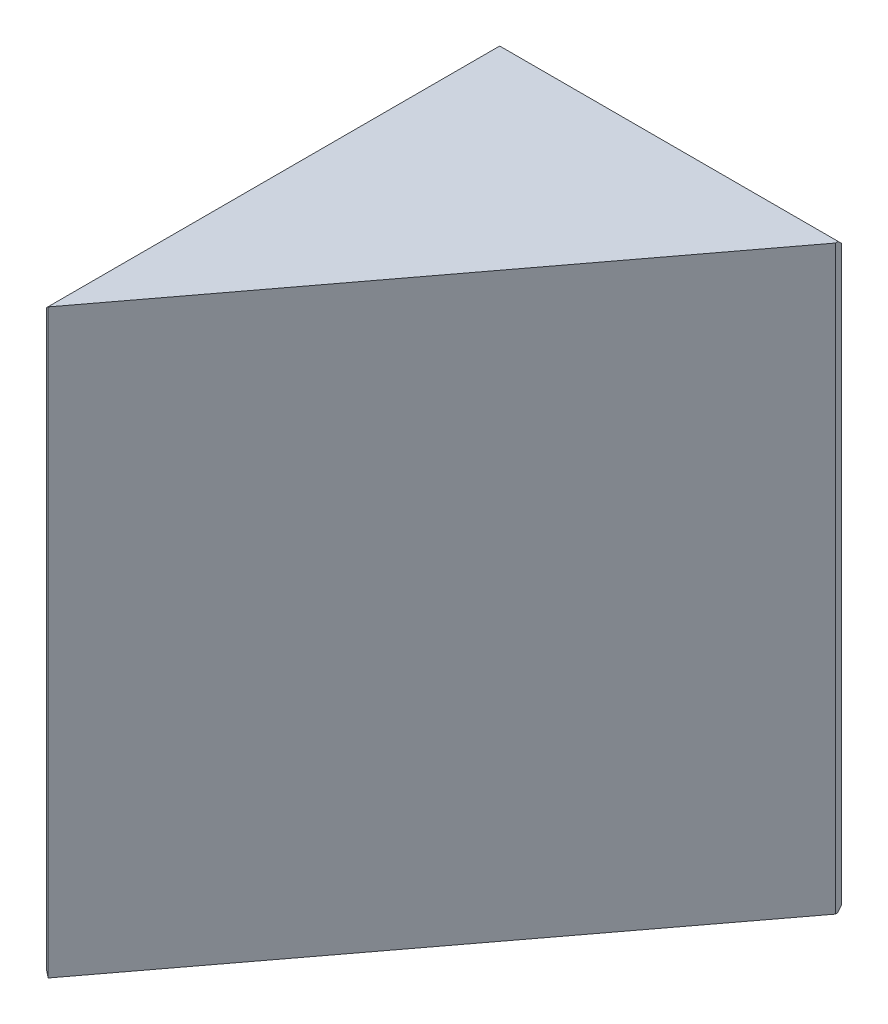
ISO-10303-21;
HEADER;
FILE_DESCRIPTION(('STEP AP214'),'2;1');
FILE_NAME('part.step','',(''),(''),'','','');
FILE_SCHEMA(('AUTOMOTIVE_DESIGN { 1 0 10303 214 1 1 1 1 }'));
ENDSEC;
DATA;
#1=APPLICATION_CONTEXT('core data for automotive mechanical design processes');
#2=APPLICATION_PROTOCOL_DEFINITION('international standard','automotive_design',2000,#1);
#3=PRODUCT_CONTEXT('',#1,'mechanical');
#4=PRODUCT('Part','Part','',(#3));
#5=PRODUCT_RELATED_PRODUCT_CATEGORY('part','',(#4));
#6=PRODUCT_DEFINITION_FORMATION('','',#4);
#7=PRODUCT_DEFINITION_CONTEXT('part definition',#1,'design');
#8=PRODUCT_DEFINITION('design','',#6,#7);
#9=PRODUCT_DEFINITION_SHAPE('','',#8);
#10=(LENGTH_UNIT() NAMED_UNIT(*) SI_UNIT(.MILLI.,.METRE.));
#11=(NAMED_UNIT(*) PLANE_ANGLE_UNIT() SI_UNIT($,.RADIAN.));
#12=(NAMED_UNIT(*) SI_UNIT($,.STERADIAN.) SOLID_ANGLE_UNIT());
#13=UNCERTAINTY_MEASURE_WITH_UNIT(LENGTH_MEASURE(1.E-05),#10,'distance_accuracy_value','');
#14=(GEOMETRIC_REPRESENTATION_CONTEXT(3) GLOBAL_UNCERTAINTY_ASSIGNED_CONTEXT((#13)) GLOBAL_UNIT_ASSIGNED_CONTEXT((#10,
#11,#12)) REPRESENTATION_CONTEXT('',''));
#15=CARTESIAN_POINT('',(0.,0.,0.));
#16=DIRECTION('',(0.,0.,1.));
#17=DIRECTION('',(1.,0.,0.));
#18=AXIS2_PLACEMENT_3D('',#15,#16,#17);
#19=CARTESIAN_POINT('',(0.,20.,-15.9018961505421));
#20=DIRECTION('',(1.,0.,0.));
#21=DIRECTION('',(0.,0.,-1.));
#22=AXIS2_PLACEMENT_3D('',#19,#20,#21);
#23=PLANE('',#22);
#24=DIRECTION('',(0.,-1.,0.));
#25=VECTOR('',#24,1.);
#26=CARTESIAN_POINT('',(0.,20.,-15.7518961505421));
#27=LINE('',#26,#25);
#28=CARTESIAN_POINT('',(0.,19.85,-15.7518961505421));
#29=VERTEX_POINT('',#28);
#30=CARTESIAN_POINT('',(0.,0.150000000000008,-15.7518961505421));
#31=VERTEX_POINT('',#30);
#32=EDGE_CURVE('E49',#29,#31,#27,.T.);
#33=ORIENTED_EDGE('',*,*,#32,.T.);
#34=DIRECTION('',(0.,0.,1.));
#35=VECTOR('',#34,1.);
#36=CARTESIAN_POINT('',(0.,0.150000000000008,-0.300000000000003));
#37=LINE('',#36,#35);
#38=CARTESIAN_POINT('',(0.,0.150000000000003,-0.300000000000003));
#39=VERTEX_POINT('',#38);
#40=EDGE_CURVE('E166',#31,#39,#37,.T.);
#41=ORIENTED_EDGE('',*,*,#40,.T.);
#42=DIRECTION('',(0.,1.,0.));
#43=VECTOR('',#42,1.);
#44=CARTESIAN_POINT('',(0.,20.,-0.300000000000003));
#45=LINE('',#44,#43);
#46=CARTESIAN_POINT('',(0.,19.85,-0.300000000000003));
#47=VERTEX_POINT('',#46);
#48=EDGE_CURVE('E114',#39,#47,#45,.T.);
#49=ORIENTED_EDGE('',*,*,#48,.T.);
#50=DIRECTION('',(0.,0.,-1.));
#51=VECTOR('',#50,1.);
#52=CARTESIAN_POINT('',(0.,19.85,-15.9018961505421));
#53=LINE('',#52,#51);
#54=EDGE_CURVE('E54',#47,#29,#53,.T.);
#55=ORIENTED_EDGE('',*,*,#54,.T.);
#56=EDGE_LOOP('',(#33,#41,#49,#55));
#57=FACE_BOUND('',#56,.T.);
#58=ADVANCED_FACE('F32',(#57),#23,.F.);
#59=CARTESIAN_POINT('',(0.,20.,0.));
#60=DIRECTION('',(-0.79863551004729,0.,-0.601815023152052));
#61=DIRECTION('',(-0.601815023152052,0.,0.79863551004729));
#62=AXIS2_PLACEMENT_3D('',#59,#60,#61);
#63=PLANE('',#62);
#64=DIRECTION('',(0.601815023152052,0.,-0.79863551004729));
#65=VECTOR('',#64,1.);
#66=CARTESIAN_POINT('',(0.,0.,0.));
#67=LINE('',#66,#65);
#68=CARTESIAN_POINT('',(0.157530336770824,0.,-0.209049817659837));
#69=VERTEX_POINT('',#68);
#70=CARTESIAN_POINT('',(11.8023937416095,0.,-15.6623054975279));
#71=VERTEX_POINT('',#70);
#72=EDGE_CURVE('E120',#69,#71,#67,.T.);
#73=ORIENTED_EDGE('',*,*,#72,.T.);
#74=DIRECTION('',(0.,1.,0.));
#75=VECTOR('',#74,1.);
#76=CARTESIAN_POINT('',(11.8023937416095,20.,-15.6623054975279));
#77=LINE('',#76,#75);
#78=CARTESIAN_POINT('',(11.8023937416095,20.,-15.6623054975279));
#79=VERTEX_POINT('',#78);
#80=EDGE_CURVE('E140',#71,#79,#77,.T.);
#81=ORIENTED_EDGE('',*,*,#80,.T.);
#82=DIRECTION('',(0.601815023152052,0.,-0.79863551004729));
#83=VECTOR('',#82,1.);
#84=CARTESIAN_POINT('',(0.,20.,0.));
#85=LINE('',#84,#83);
#86=CARTESIAN_POINT('',(0.157530336770822,20.,-0.209049817659837));
#87=VERTEX_POINT('',#86);
#88=EDGE_CURVE('E123',#87,#79,#85,.T.);
#89=ORIENTED_EDGE('',*,*,#88,.F.);
#90=DIRECTION('',(0.,-1.,0.));
#91=VECTOR('',#90,1.);
#92=CARTESIAN_POINT('',(0.157530336770822,20.,-0.209049817659837));
#93=LINE('',#92,#91);
#94=EDGE_CURVE('E109',#87,#69,#93,.T.);
#95=ORIENTED_EDGE('',*,*,#94,.T.);
#96=EDGE_LOOP('',(#73,#81,#89,#95));
#97=FACE_BOUND('',#96,.T.);
#98=ADVANCED_FACE('F119',(#97),#63,.F.);
#99=CARTESIAN_POINT('',(11.9829382485551,20.,-15.9018961505421));
#100=DIRECTION('',(0.,0.,1.));
#101=DIRECTION('',(1.,0.,0.));
#102=AXIS2_PLACEMENT_3D('',#99,#100,#101);
#103=PLANE('',#102);
#104=DIRECTION('',(0.,-1.,0.));
#105=VECTOR('',#104,1.);
#106=CARTESIAN_POINT('',(11.768721471248,20.,-15.9018961505421));
#107=LINE('',#106,#105);
#108=CARTESIAN_POINT('',(11.768721471248,19.85,-15.9018961505421));
#109=VERTEX_POINT('',#108);
#110=CARTESIAN_POINT('',(11.768721471248,0.15000000000001,-15.9018961505421));
#111=VERTEX_POINT('',#110);
#112=EDGE_CURVE('E136',#109,#111,#107,.T.);
#113=ORIENTED_EDGE('',*,*,#112,.T.);
#114=DIRECTION('',(-1.,0.,0.));
#115=VECTOR('',#114,1.);
#116=CARTESIAN_POINT('',(0.,0.150000000000008,-15.9018961505421));
#117=LINE('',#116,#115);
#118=CARTESIAN_POINT('',(0.150000000000006,0.150000000000008,-15.9018961505421));
#119=VERTEX_POINT('',#118);
#120=EDGE_CURVE('E149',#111,#119,#117,.T.);
#121=ORIENTED_EDGE('',*,*,#120,.T.);
#122=DIRECTION('',(0.,1.,0.));
#123=VECTOR('',#122,1.);
#124=CARTESIAN_POINT('',(0.150000000000006,20.,-15.9018961505421));
#125=LINE('',#124,#123);
#126=CARTESIAN_POINT('',(0.150000000000006,19.85,-15.9018961505421));
#127=VERTEX_POINT('',#126);
#128=EDGE_CURVE('E145',#119,#127,#125,.T.);
#129=ORIENTED_EDGE('',*,*,#128,.T.);
#130=DIRECTION('',(1.,0.,0.));
#131=VECTOR('',#130,1.);
#132=CARTESIAN_POINT('',(11.9829382485551,19.85,-15.9018961505421));
#133=LINE('',#132,#131);
#134=EDGE_CURVE('E147',#127,#109,#133,.T.);
#135=ORIENTED_EDGE('',*,*,#134,.T.);
#136=EDGE_LOOP('',(#113,#121,#129,#135));
#137=FACE_BOUND('',#136,.T.);
#138=ADVANCED_FACE('F195',(#137),#103,.F.);
#139=CARTESIAN_POINT('',(0.,20.,-15.9018961505421));
#140=DIRECTION('',(0.,-1.,0.));
#141=DIRECTION('',(0.,0.,-1.));
#142=AXIS2_PLACEMENT_3D('',#139,#140,#141);
#143=PLANE('',#142);
#144=DIRECTION('',(0.139173100960057,0.,0.990268068741572));
#145=VECTOR('',#144,1.);
#146=CARTESIAN_POINT('',(11.768721471248,20.,-15.9018961505421));
#147=LINE('',#146,#145);
#148=CARTESIAN_POINT('',(11.7898025964534,20.,-15.7518961505421));
#149=VERTEX_POINT('',#148);
#150=EDGE_CURVE('E142',#79,#149,#147,.F.);
#151=ORIENTED_EDGE('',*,*,#150,.T.);
#152=DIRECTION('',(-1.,0.,0.));
#153=VECTOR('',#152,1.);
#154=CARTESIAN_POINT('',(0.,20.,-15.7518961505421));
#155=LINE('',#154,#153);
#156=CARTESIAN_POINT('',(0.150000000000007,20.,-15.7518961505421));
#157=VERTEX_POINT('',#156);
#158=EDGE_CURVE('E162',#149,#157,#155,.T.);
#159=ORIENTED_EDGE('',*,*,#158,.T.);
#160=DIRECTION('',(0.,0.,1.));
#161=VECTOR('',#160,1.);
#162=CARTESIAN_POINT('',(0.150000000000007,20.,-15.9018961505421));
#163=LINE('',#162,#161);
#164=CARTESIAN_POINT('',(0.150000000000006,20.,-0.213397459621556));
#165=VERTEX_POINT('',#164);
#166=EDGE_CURVE('E160',#157,#165,#163,.T.);
#167=ORIENTED_EDGE('',*,*,#166,.T.);
#168=DIRECTION('',(-0.86602540378444,0.,-0.499999999999998));
#169=VECTOR('',#168,1.);
#170=CARTESIAN_POINT('',(0.157530336770822,20.,-0.209049817659837));
#171=LINE('',#170,#169);
#172=EDGE_CURVE('E134',#165,#87,#171,.F.);
#173=ORIENTED_EDGE('',*,*,#172,.T.);
#174=ORIENTED_EDGE('',*,*,#88,.T.);
#175=EDGE_LOOP('',(#151,#159,#167,#173,#174));
#176=FACE_BOUND('',#175,.T.);
#177=ADVANCED_FACE('F292',(#176),#143,.F.);
#178=CARTESIAN_POINT('',(0.,0.,-15.9018961505421));
#179=DIRECTION('',(0.,-1.,0.));
#180=DIRECTION('',(0.,0.,-1.));
#181=AXIS2_PLACEMENT_3D('',#178,#179,#180);
#182=PLANE('',#181);
#183=DIRECTION('',(0.,0.,-1.));
#184=VECTOR('',#183,1.);
#185=CARTESIAN_POINT('',(0.150000000000007,0.,-15.9018961505421));
#186=LINE('',#185,#184);
#187=CARTESIAN_POINT('',(0.15000000000001,0.,-0.213397459621556));
#188=VERTEX_POINT('',#187);
#189=CARTESIAN_POINT('',(0.150000000000007,0.,-15.7518961505421));
#190=VERTEX_POINT('',#189);
#191=EDGE_CURVE('E152',#188,#190,#186,.T.);
#192=ORIENTED_EDGE('',*,*,#191,.T.);
#193=DIRECTION('',(1.,0.,0.));
#194=VECTOR('',#193,1.);
#195=CARTESIAN_POINT('',(11.768721471248,0.,-15.7518961505421));
#196=LINE('',#195,#194);
#197=CARTESIAN_POINT('',(11.7898025964534,0.,-15.7518961505421));
#198=VERTEX_POINT('',#197);
#199=EDGE_CURVE('E154',#190,#198,#196,.T.);
#200=ORIENTED_EDGE('',*,*,#199,.T.);
#201=DIRECTION('',(-0.139173100960057,0.,-0.990268068741572));
#202=VECTOR('',#201,1.);
#203=CARTESIAN_POINT('',(11.5407713158628,0.,-17.5238457843827));
#204=LINE('',#203,#202);
#205=EDGE_CURVE('E127',#198,#71,#204,.F.);
#206=ORIENTED_EDGE('',*,*,#205,.T.);
#207=ORIENTED_EDGE('',*,*,#72,.F.);
#208=DIRECTION('',(0.86602540378444,0.,0.499999999999998));
#209=VECTOR('',#208,1.);
#210=CARTESIAN_POINT('',(-6.75581920678801,0.,-4.20047403763548));
#211=LINE('',#210,#209);
#212=EDGE_CURVE('E104',#69,#188,#211,.F.);
#213=ORIENTED_EDGE('',*,*,#212,.T.);
#214=EDGE_LOOP('',(#192,#200,#206,#207,#213));
#215=FACE_BOUND('',#214,.T.);
#216=ADVANCED_FACE('F125',(#215),#182,.T.);
#217=CARTESIAN_POINT('',(0.157530336770822,20.,-0.209049817659837));
#218=DIRECTION('',(0.499999999999998,0.,-0.86602540378444));
#219=DIRECTION('',(-0.86602540378444,0.,-0.499999999999998));
#220=AXIS2_PLACEMENT_3D('',#217,#218,#219);
#221=PLANE('',#220);
#222=ORIENTED_EDGE('',*,*,#48,.F.);
#223=DIRECTION('',(-0.654653670707978,0.654653670707978,-0.377964473009225));
#224=VECTOR('',#223,1.);
#225=CARTESIAN_POINT('',(-8.41712552184526,8.56712552184526,-5.1596296858402));
#226=LINE('',#225,#224);
#227=EDGE_CURVE('E11',#39,#188,#226,.F.);
#228=ORIENTED_EDGE('',*,*,#227,.T.);
#229=ORIENTED_EDGE('',*,*,#212,.F.);
#230=ORIENTED_EDGE('',*,*,#94,.F.);
#231=ORIENTED_EDGE('',*,*,#172,.F.);
#232=DIRECTION('',(-0.654653670707978,-0.654653670707978,-0.377964473009225));
#233=VECTOR('',#232,1.);
#234=CARTESIAN_POINT('',(0.15430304958333,20.0043030495833,-0.210913092786288));
#235=LINE('',#234,#233);
#236=EDGE_CURVE('E41',#165,#47,#235,.T.);
#237=ORIENTED_EDGE('',*,*,#236,.T.);
#238=EDGE_LOOP('',(#222,#228,#229,#230,#231,#237));
#239=FACE_BOUND('',#238,.T.);
#240=ADVANCED_FACE('F107',(#239),#221,.F.);
#241=CARTESIAN_POINT('',(11.768721471248,20.,-15.9018961505421));
#242=DIRECTION('',(-0.990268068741571,0.,0.139173100960057));
#243=DIRECTION('',(0.139173100960057,0.,0.990268068741572));
#244=AXIS2_PLACEMENT_3D('',#241,#242,#243);
#245=PLANE('',#244);
#246=ORIENTED_EDGE('',*,*,#205,.F.);
#247=DIRECTION('',(0.0988902636106737,-0.703640787534027,0.703640787534027));
#248=VECTOR('',#247,1.);
#249=CARTESIAN_POINT('',(10.3874944953637,9.97794060394789,-25.7298367544899));
#250=LINE('',#249,#248);
#251=EDGE_CURVE('E158',#198,#111,#250,.F.);
#252=ORIENTED_EDGE('',*,*,#251,.T.);
#253=ORIENTED_EDGE('',*,*,#112,.F.);
#254=DIRECTION('',(0.0988902636106737,0.703640787534027,0.703640787534027));
#255=VECTOR('',#254,1.);
#256=CARTESIAN_POINT('',(11.779158954693,19.9242665536822,-15.8276295968598));
#257=LINE('',#256,#255);
#258=EDGE_CURVE('E156',#109,#149,#257,.T.);
#259=ORIENTED_EDGE('',*,*,#258,.T.);
#260=ORIENTED_EDGE('',*,*,#150,.F.);
#261=ORIENTED_EDGE('',*,*,#80,.F.);
#262=EDGE_LOOP('',(#246,#252,#253,#259,#260,#261));
#263=FACE_BOUND('',#262,.T.);
#264=ADVANCED_FACE('F199',(#263),#245,.F.);
#265=CARTESIAN_POINT('',(0.,20.,-15.7518961505421));
#266=DIRECTION('',(0.,-0.707106781186548,0.707106781186548));
#267=DIRECTION('',(0.,-0.707106781186548,-0.707106781186548));
#268=AXIS2_PLACEMENT_3D('',#265,#266,#267);
#269=PLANE('',#268);
#270=ORIENTED_EDGE('',*,*,#258,.F.);
#271=ORIENTED_EDGE('',*,*,#134,.F.);
#272=DIRECTION('',(0.,0.707106781186548,0.707106781186548));
#273=VECTOR('',#272,1.);
#274=CARTESIAN_POINT('',(0.150000000000007,20.,-15.7518961505421));
#275=LINE('',#274,#273);
#276=EDGE_CURVE('E36',#157,#127,#275,.F.);
#277=ORIENTED_EDGE('',*,*,#276,.F.);
#278=ORIENTED_EDGE('',*,*,#158,.F.);
#279=EDGE_LOOP('',(#270,#271,#277,#278));
#280=FACE_BOUND('',#279,.T.);
#281=ADVANCED_FACE('F34',(#280),#269,.F.);
#282=CARTESIAN_POINT('',(0.150000000000007,20.,-15.9018961505421));
#283=DIRECTION('',(0.707106781186548,-0.707106781186548,0.));
#284=DIRECTION('',(0.707106781186548,0.707106781186548,0.));
#285=AXIS2_PLACEMENT_3D('',#282,#283,#284);
#286=PLANE('',#285);
#287=ORIENTED_EDGE('',*,*,#236,.F.);
#288=ORIENTED_EDGE('',*,*,#166,.F.);
#289=DIRECTION('',(-0.707106781186547,-0.707106781186547,0.));
#290=VECTOR('',#289,1.);
#291=CARTESIAN_POINT('',(0.150000000000007,20.,-15.7518961505421));
#292=LINE('',#291,#290);
#293=EDGE_CURVE('E131',#29,#157,#292,.F.);
#294=ORIENTED_EDGE('',*,*,#293,.F.);
#295=ORIENTED_EDGE('',*,*,#54,.F.);
#296=EDGE_LOOP('',(#287,#288,#294,#295));
#297=FACE_BOUND('',#296,.T.);
#298=ADVANCED_FACE('F187',(#297),#286,.F.);
#299=CARTESIAN_POINT('',(0.150000000000007,20.,-15.7518961505421));
#300=DIRECTION('',(-0.577350269189627,0.577350269189627,-0.577350269189624));
#301=DIRECTION('',(-0.707106781186547,-0.707106781186547,0.));
#302=AXIS2_PLACEMENT_3D('',#299,#300,#301);
#303=PLANE('',#302);
#304=ORIENTED_EDGE('',*,*,#293,.T.);
#305=ORIENTED_EDGE('',*,*,#276,.T.);
#306=DIRECTION('',(0.707106781186546,0.,-0.70710678118655));
#307=VECTOR('',#306,1.);
#308=CARTESIAN_POINT('',(0.0750000000000026,19.85,-15.8268961505421));
#309=LINE('',#308,#307);
#310=EDGE_CURVE('E177',#29,#127,#309,.T.);
#311=ORIENTED_EDGE('',*,*,#310,.F.);
#312=EDGE_LOOP('',(#304,#305,#311));
#313=FACE_BOUND('',#312,.T.);
#314=ADVANCED_FACE('F182',(#313),#303,.T.);
#315=CARTESIAN_POINT('',(0.,20.,-15.7518961505421));
#316=DIRECTION('',(0.707106781186549,0.,0.707106781186545));
#317=DIRECTION('',(0.707106781186546,0.,-0.70710678118655));
#318=AXIS2_PLACEMENT_3D('',#315,#316,#317);
#319=PLANE('',#318);
#320=ORIENTED_EDGE('',*,*,#310,.T.);
#321=ORIENTED_EDGE('',*,*,#128,.F.);
#322=DIRECTION('',(-0.707106781186546,0.,0.70710678118655));
#323=VECTOR('',#322,1.);
#324=CARTESIAN_POINT('',(0.150000000000006,0.150000000000008,-15.9018961505421));
#325=LINE('',#324,#323);
#326=EDGE_CURVE('E174',#31,#119,#325,.F.);
#327=ORIENTED_EDGE('',*,*,#326,.F.);
#328=ORIENTED_EDGE('',*,*,#32,.F.);
#329=EDGE_LOOP('',(#320,#321,#327,#328));
#330=FACE_BOUND('',#329,.T.);
#331=ADVANCED_FACE('F211',(#330),#319,.F.);
#332=CARTESIAN_POINT('',(0.,0.150000000000008,-15.9018961505421));
#333=DIRECTION('',(-0.707106781186548,-0.707106781186548,0.));
#334=DIRECTION('',(0.707106781186548,-0.707106781186548,0.));
#335=AXIS2_PLACEMENT_3D('',#332,#333,#334);
#336=PLANE('',#335);
#337=ORIENTED_EDGE('',*,*,#227,.F.);
#338=ORIENTED_EDGE('',*,*,#40,.F.);
#339=DIRECTION('',(-0.707106781186547,0.707106781186547,0.));
#340=VECTOR('',#339,1.);
#341=CARTESIAN_POINT('',(0.0750000000000026,0.0750000000000043,-15.7518961505421));
#342=LINE('',#341,#340);
#343=EDGE_CURVE('E171',#190,#31,#342,.T.);
#344=ORIENTED_EDGE('',*,*,#343,.F.);
#345=ORIENTED_EDGE('',*,*,#191,.F.);
#346=EDGE_LOOP('',(#337,#338,#344,#345));
#347=FACE_BOUND('',#346,.T.);
#348=ADVANCED_FACE('F213',(#347),#336,.T.);
#349=CARTESIAN_POINT('',(0.150000000000006,0.150000000000008,-15.9018961505421));
#350=DIRECTION('',(-0.577350269189627,-0.577350269189627,-0.577350269189624));
#351=DIRECTION('',(0.707106781186547,-0.707106781186547,0.));
#352=AXIS2_PLACEMENT_3D('',#349,#350,#351);
#353=PLANE('',#352);
#354=ORIENTED_EDGE('',*,*,#343,.T.);
#355=ORIENTED_EDGE('',*,*,#326,.T.);
#356=DIRECTION('',(0.,-0.707106781186548,0.707106781186548));
#357=VECTOR('',#356,1.);
#358=CARTESIAN_POINT('',(0.150000000000006,0.150000000000008,-15.9018961505421));
#359=LINE('',#358,#357);
#360=EDGE_CURVE('E169',#190,#119,#359,.F.);
#361=ORIENTED_EDGE('',*,*,#360,.F.);
#362=EDGE_LOOP('',(#354,#355,#361));
#363=FACE_BOUND('',#362,.T.);
#364=ADVANCED_FACE('F208',(#363),#353,.T.);
#365=CARTESIAN_POINT('',(11.9829382485551,0.150000000000008,-15.9018961505421));
#366=DIRECTION('',(0.,-0.707106781186548,-0.707106781186548));
#367=DIRECTION('',(0.,0.707106781186548,-0.707106781186548));
#368=AXIS2_PLACEMENT_3D('',#365,#366,#367);
#369=PLANE('',#368);
#370=ORIENTED_EDGE('',*,*,#251,.F.);
#371=ORIENTED_EDGE('',*,*,#199,.F.);
#372=ORIENTED_EDGE('',*,*,#360,.T.);
#373=ORIENTED_EDGE('',*,*,#120,.F.);
#374=EDGE_LOOP('',(#370,#371,#372,#373));
#375=FACE_BOUND('',#374,.T.);
#376=ADVANCED_FACE('F204',(#375),#369,.T.);
#377=CLOSED_SHELL('',(#58,#98,#138,#177,#216,#240,#264,#281,#298,#314,#331,#348,#364,#376));
#378=MANIFOLD_SOLID_BREP('B2',#377);
#379=ADVANCED_BREP_SHAPE_REPRESENTATION('',(#18,#378),#14);
#380=SHAPE_DEFINITION_REPRESENTATION(#9,#379);
ENDSEC;
END-ISO-10303-21;
